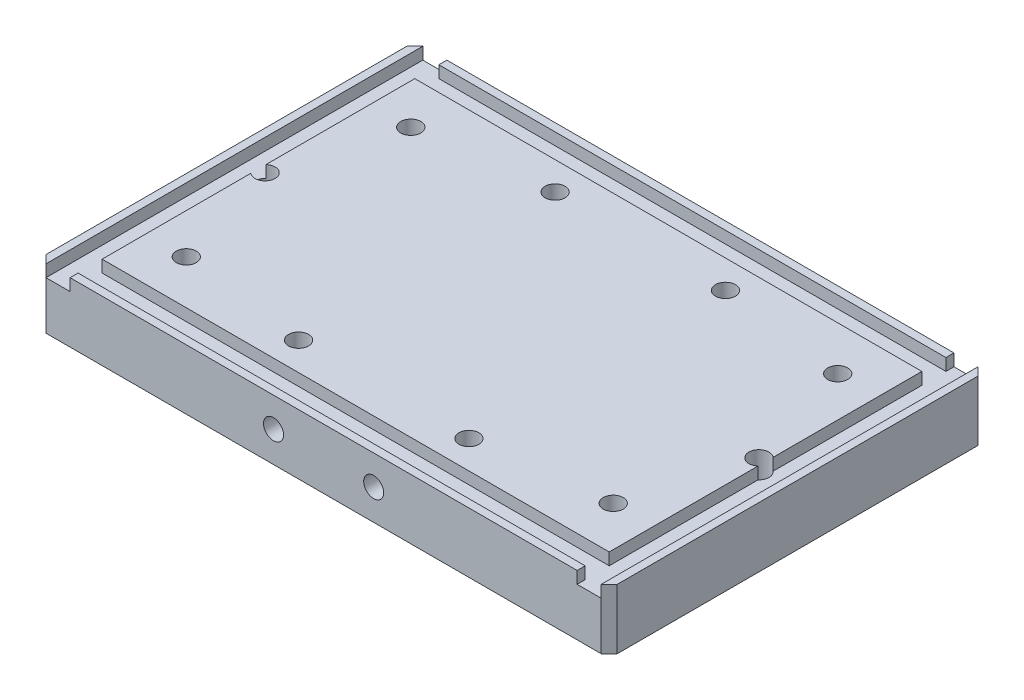
ISO-10303-21;
HEADER;
FILE_DESCRIPTION(('STEP AP214'),'2;1');
FILE_NAME('part.step','',(''),(''),'','','');
FILE_SCHEMA(('AUTOMOTIVE_DESIGN { 1 0 10303 214 1 1 1 1 }'));
ENDSEC;
DATA;
#1=APPLICATION_CONTEXT('core data for automotive mechanical design processes');
#2=APPLICATION_PROTOCOL_DEFINITION('international standard','automotive_design',2000,#1);
#3=PRODUCT_CONTEXT('',#1,'mechanical');
#4=PRODUCT('Part','Part','',(#3));
#5=PRODUCT_RELATED_PRODUCT_CATEGORY('part','',(#4));
#6=PRODUCT_DEFINITION_FORMATION('','',#4);
#7=PRODUCT_DEFINITION_CONTEXT('part definition',#1,'design');
#8=PRODUCT_DEFINITION('design','',#6,#7);
#9=PRODUCT_DEFINITION_SHAPE('','',#8);
#10=(LENGTH_UNIT() NAMED_UNIT(*) SI_UNIT(.MILLI.,.METRE.));
#11=(NAMED_UNIT(*) PLANE_ANGLE_UNIT() SI_UNIT($,.RADIAN.));
#12=(NAMED_UNIT(*) SI_UNIT($,.STERADIAN.) SOLID_ANGLE_UNIT());
#13=UNCERTAINTY_MEASURE_WITH_UNIT(LENGTH_MEASURE(1.E-05),#10,'distance_accuracy_value','');
#14=(GEOMETRIC_REPRESENTATION_CONTEXT(3) GLOBAL_UNCERTAINTY_ASSIGNED_CONTEXT((#13)) GLOBAL_UNIT_ASSIGNED_CONTEXT((#10,
#11,#12)) REPRESENTATION_CONTEXT('',''));
#15=CARTESIAN_POINT('',(0.,0.,0.));
#16=DIRECTION('',(0.,0.,1.));
#17=DIRECTION('',(1.,0.,0.));
#18=AXIS2_PLACEMENT_3D('',#15,#16,#17);
#19=CARTESIAN_POINT('',(134.5,12.,0.));
#20=DIRECTION('',(1.,0.,0.));
#21=DIRECTION('',(0.,0.,-1.));
#22=AXIS2_PLACEMENT_3D('',#19,#20,#21);
#23=PLANE('',#22);
#24=DIRECTION('',(0.,1.,0.));
#25=VECTOR('',#24,1.);
#26=CARTESIAN_POINT('',(134.5,0.,-48.8781639970993));
#27=LINE('',#26,#25);
#28=CARTESIAN_POINT('',(134.5,12.,-48.8781639970993));
#29=VERTEX_POINT('',#28);
#30=CARTESIAN_POINT('',(134.5,15.,-48.8781639970993));
#31=VERTEX_POINT('',#30);
#32=EDGE_CURVE('E221',#29,#31,#27,.T.);
#33=ORIENTED_EDGE('',*,*,#32,.F.);
#34=DIRECTION('',(0.,0.,-1.));
#35=VECTOR('',#34,1.);
#36=CARTESIAN_POINT('',(134.5,12.,0.));
#37=LINE('',#36,#35);
#38=CARTESIAN_POINT('',(134.5,12.,-86.));
#39=VERTEX_POINT('',#38);
#40=EDGE_CURVE('E285',#29,#39,#37,.T.);
#41=ORIENTED_EDGE('',*,*,#40,.T.);
#42=DIRECTION('',(0.,1.,0.));
#43=VECTOR('',#42,1.);
#44=CARTESIAN_POINT('',(134.5,12.,-86.));
#45=LINE('',#44,#43);
#46=CARTESIAN_POINT('',(134.5,15.,-86.));
#47=VERTEX_POINT('',#46);
#48=EDGE_CURVE('E325',#39,#47,#45,.T.);
#49=ORIENTED_EDGE('',*,*,#48,.T.);
#50=DIRECTION('',(0.,0.,-1.));
#51=VECTOR('',#50,1.);
#52=CARTESIAN_POINT('',(134.5,15.,0.));
#53=LINE('',#52,#51);
#54=EDGE_CURVE('E243',#31,#47,#53,.T.);
#55=ORIENTED_EDGE('',*,*,#54,.F.);
#56=EDGE_LOOP('',(#33,#41,#49,#55));
#57=FACE_BOUND('',#56,.T.);
#58=ADVANCED_FACE('F41',(#57),#23,.T.);
#59=CARTESIAN_POINT('',(8.,12.,0.));
#60=DIRECTION('',(1.,0.,0.));
#61=DIRECTION('',(0.,0.,-1.));
#62=AXIS2_PLACEMENT_3D('',#59,#60,#61);
#63=PLANE('',#62);
#64=DIRECTION('',(0.,0.,-1.));
#65=VECTOR('',#64,1.);
#66=CARTESIAN_POINT('',(8.,12.,0.));
#67=LINE('',#66,#65);
#68=CARTESIAN_POINT('',(8.,12.,-48.8781639970993));
#69=VERTEX_POINT('',#68);
#70=CARTESIAN_POINT('',(8.,12.,-86.));
#71=VERTEX_POINT('',#70);
#72=EDGE_CURVE('E269',#69,#71,#67,.T.);
#73=ORIENTED_EDGE('',*,*,#72,.F.);
#74=DIRECTION('',(0.,1.,0.));
#75=VECTOR('',#74,1.);
#76=CARTESIAN_POINT('',(8.,0.,-48.8781639970993));
#77=LINE('',#76,#75);
#78=CARTESIAN_POINT('',(8.,15.,-48.8781639970993));
#79=VERTEX_POINT('',#78);
#80=EDGE_CURVE('E277',#69,#79,#77,.T.);
#81=ORIENTED_EDGE('',*,*,#80,.T.);
#82=DIRECTION('',(0.,0.,-1.));
#83=VECTOR('',#82,1.);
#84=CARTESIAN_POINT('',(8.,15.,0.));
#85=LINE('',#84,#83);
#86=CARTESIAN_POINT('',(8.,15.,-86.));
#87=VERTEX_POINT('',#86);
#88=EDGE_CURVE('E314',#79,#87,#85,.T.);
#89=ORIENTED_EDGE('',*,*,#88,.T.);
#90=DIRECTION('',(0.,1.,0.));
#91=VECTOR('',#90,1.);
#92=CARTESIAN_POINT('',(8.,12.,-86.));
#93=LINE('',#92,#91);
#94=EDGE_CURVE('E327',#71,#87,#93,.T.);
#95=ORIENTED_EDGE('',*,*,#94,.F.);
#96=EDGE_LOOP('',(#73,#81,#89,#95));
#97=FACE_BOUND('',#96,.T.);
#98=ADVANCED_FACE('F451',(#97),#63,.F.);
#99=CARTESIAN_POINT('',(0.,15.,-94.));
#100=DIRECTION('',(0.,0.,1.));
#101=DIRECTION('',(1.,0.,0.));
#102=AXIS2_PLACEMENT_3D('',#99,#100,#101);
#103=PLANE('',#102);
#104=DIRECTION('',(-1.,0.,0.));
#105=VECTOR('',#104,1.);
#106=CARTESIAN_POINT('',(0.,0.,-94.));
#107=LINE('',#106,#105);
#108=CARTESIAN_POINT('',(140.5,0.,-94.));
#109=VERTEX_POINT('',#108);
#110=CARTESIAN_POINT('',(2.00000000000003,0.,-94.));
#111=VERTEX_POINT('',#110);
#112=EDGE_CURVE('E345',#109,#111,#107,.T.);
#113=ORIENTED_EDGE('',*,*,#112,.T.);
#114=DIRECTION('',(0.,1.,0.));
#115=VECTOR('',#114,1.);
#116=CARTESIAN_POINT('',(2.00000000000003,15.,-94.));
#117=LINE('',#116,#115);
#118=CARTESIAN_POINT('',(2.,12.,-94.));
#119=VERTEX_POINT('',#118);
#120=EDGE_CURVE('E385',#111,#119,#117,.T.);
#121=ORIENTED_EDGE('',*,*,#120,.T.);
#122=DIRECTION('',(-1.,0.,0.));
#123=VECTOR('',#122,1.);
#124=CARTESIAN_POINT('',(0.,12.,-94.));
#125=LINE('',#124,#123);
#126=CARTESIAN_POINT('',(8.,12.,-94.));
#127=VERTEX_POINT('',#126);
#128=EDGE_CURVE('E291',#127,#119,#125,.T.);
#129=ORIENTED_EDGE('',*,*,#128,.F.);
#130=DIRECTION('',(0.,1.,0.));
#131=VECTOR('',#130,1.);
#132=CARTESIAN_POINT('',(8.,12.,-94.));
#133=LINE('',#132,#131);
#134=CARTESIAN_POINT('',(8.,15.,-94.));
#135=VERTEX_POINT('',#134);
#136=EDGE_CURVE('E431',#127,#135,#133,.T.);
#137=ORIENTED_EDGE('',*,*,#136,.T.);
#138=DIRECTION('',(-1.,0.,0.));
#139=VECTOR('',#138,1.);
#140=CARTESIAN_POINT('',(0.,15.,-94.));
#141=LINE('',#140,#139);
#142=CARTESIAN_POINT('',(134.5,15.,-94.));
#143=VERTEX_POINT('',#142);
#144=EDGE_CURVE('E226',#143,#135,#141,.T.);
#145=ORIENTED_EDGE('',*,*,#144,.F.);
#146=DIRECTION('',(0.,1.,0.));
#147=VECTOR('',#146,1.);
#148=CARTESIAN_POINT('',(134.5,12.,-94.));
#149=LINE('',#148,#147);
#150=CARTESIAN_POINT('',(134.5,12.,-94.));
#151=VERTEX_POINT('',#150);
#152=EDGE_CURVE('E414',#151,#143,#149,.T.);
#153=ORIENTED_EDGE('',*,*,#152,.F.);
#154=DIRECTION('',(-1.,0.,0.));
#155=VECTOR('',#154,1.);
#156=CARTESIAN_POINT('',(0.,12.,-94.));
#157=LINE('',#156,#155);
#158=CARTESIAN_POINT('',(140.5,12.,-94.));
#159=VERTEX_POINT('',#158);
#160=EDGE_CURVE('E309',#159,#151,#157,.T.);
#161=ORIENTED_EDGE('',*,*,#160,.F.);
#162=DIRECTION('',(0.,-1.,0.));
#163=VECTOR('',#162,1.);
#164=CARTESIAN_POINT('',(140.5,15.,-94.));
#165=LINE('',#164,#163);
#166=EDGE_CURVE('E383',#159,#109,#165,.T.);
#167=ORIENTED_EDGE('',*,*,#166,.T.);
#168=EDGE_LOOP('',(#113,#121,#129,#137,#145,#153,#161,#167));
#169=FACE_BOUND('',#168,.T.);
#170=ADVANCED_FACE('F573',(#169),#103,.F.);
#171=CARTESIAN_POINT('',(0.,15.,0.));
#172=DIRECTION('',(0.,-1.,0.));
#173=DIRECTION('',(0.,0.,-1.));
#174=AXIS2_PLACEMENT_3D('',#171,#172,#173);
#175=PLANE('',#174);
#176=CARTESIAN_POINT('',(134.5,15.,0.));
#177=VERTEX_POINT('',#176);
#178=CARTESIAN_POINT('',(134.5,15.,-2.));
#179=VERTEX_POINT('',#178);
#180=EDGE_CURVE('E245',#177,#179,#53,.T.);
#181=ORIENTED_EDGE('',*,*,#180,.T.);
#182=DIRECTION('',(1.,0.,0.));
#183=VECTOR('',#182,1.);
#184=CARTESIAN_POINT('',(0.,15.,-2.));
#185=LINE('',#184,#183);
#186=CARTESIAN_POINT('',(8.,15.,-2.));
#187=VERTEX_POINT('',#186);
#188=EDGE_CURVE('E254',#187,#179,#185,.T.);
#189=ORIENTED_EDGE('',*,*,#188,.F.);
#190=CARTESIAN_POINT('',(8.,15.,0.));
#191=VERTEX_POINT('',#190);
#192=EDGE_CURVE('E261',#191,#187,#85,.T.);
#193=ORIENTED_EDGE('',*,*,#192,.F.);
#194=DIRECTION('',(1.,0.,0.));
#195=VECTOR('',#194,1.);
#196=CARTESIAN_POINT('',(0.,15.,0.));
#197=LINE('',#196,#195);
#198=EDGE_CURVE('E344',#191,#177,#197,.T.);
#199=ORIENTED_EDGE('',*,*,#198,.T.);
#200=EDGE_LOOP('',(#181,#189,#193,#199));
#201=FACE_BOUND('',#200,.T.);
#202=ADVANCED_FACE('F619',(#201),#175,.F.);
#203=DIRECTION('',(0.,0.,1.));
#204=VECTOR('',#203,1.);
#205=CARTESIAN_POINT('',(0.,15.,0.));
#206=LINE('',#205,#204);
#207=CARTESIAN_POINT('',(0.,15.,-92.));
#208=VERTEX_POINT('',#207);
#209=CARTESIAN_POINT('',(0.,15.,-2.00000000000004));
#210=VERTEX_POINT('',#209);
#211=EDGE_CURVE('E341',#208,#210,#206,.T.);
#212=ORIENTED_EDGE('',*,*,#211,.T.);
#213=DIRECTION('',(-0.707106781186545,0.,-0.70710678118655));
#214=VECTOR('',#213,1.);
#215=CARTESIAN_POINT('',(2.00000000000003,15.,0.));
#216=LINE('',#215,#214);
#217=CARTESIAN_POINT('',(2.,15.,0.));
#218=VERTEX_POINT('',#217);
#219=EDGE_CURVE('E381',#210,#218,#216,.F.);
#220=ORIENTED_EDGE('',*,*,#219,.T.);
#221=DIRECTION('',(0.,0.,-1.));
#222=VECTOR('',#221,1.);
#223=CARTESIAN_POINT('',(2.,15.,0.));
#224=LINE('',#223,#222);
#225=CARTESIAN_POINT('',(2.,15.,-94.));
#226=VERTEX_POINT('',#225);
#227=EDGE_CURVE('E442',#218,#226,#224,.T.);
#228=ORIENTED_EDGE('',*,*,#227,.T.);
#229=DIRECTION('',(0.707106781186552,0.,-0.707106781186543));
#230=VECTOR('',#229,1.);
#231=CARTESIAN_POINT('',(0.,15.,-92.));
#232=LINE('',#231,#230);
#233=EDGE_CURVE('E379',#226,#208,#232,.F.);
#234=ORIENTED_EDGE('',*,*,#233,.T.);
#235=EDGE_LOOP('',(#212,#220,#228,#234));
#236=FACE_BOUND('',#235,.T.);
#237=ADVANCED_FACE('F621',(#236),#175,.F.);
#238=CARTESIAN_POINT('',(134.5,15.,-92.));
#239=VERTEX_POINT('',#238);
#240=EDGE_CURVE('E250',#239,#143,#53,.T.);
#241=ORIENTED_EDGE('',*,*,#240,.T.);
#242=ORIENTED_EDGE('',*,*,#144,.T.);
#243=CARTESIAN_POINT('',(8.,15.,-92.));
#244=VERTEX_POINT('',#243);
#245=EDGE_CURVE('E247',#244,#135,#85,.T.);
#246=ORIENTED_EDGE('',*,*,#245,.F.);
#247=DIRECTION('',(1.,0.,0.));
#248=VECTOR('',#247,1.);
#249=CARTESIAN_POINT('',(0.,15.,-92.));
#250=LINE('',#249,#248);
#251=EDGE_CURVE('E242',#244,#239,#250,.T.);
#252=ORIENTED_EDGE('',*,*,#251,.T.);
#253=EDGE_LOOP('',(#241,#242,#246,#252));
#254=FACE_BOUND('',#253,.T.);
#255=ADVANCED_FACE('F441',(#254),#175,.F.);
#256=CARTESIAN_POINT('',(0.,15.,0.));
#257=DIRECTION('',(1.,0.,0.));
#258=DIRECTION('',(0.,0.,-1.));
#259=AXIS2_PLACEMENT_3D('',#256,#257,#258);
#260=PLANE('',#259);
#261=DIRECTION('',(0.,0.,1.));
#262=VECTOR('',#261,1.);
#263=CARTESIAN_POINT('',(0.,0.,0.));
#264=LINE('',#263,#262);
#265=CARTESIAN_POINT('',(0.,0.,-92.));
#266=VERTEX_POINT('',#265);
#267=CARTESIAN_POINT('',(0.,0.,-2.00000000000004));
#268=VERTEX_POINT('',#267);
#269=EDGE_CURVE('E350',#266,#268,#264,.T.);
#270=ORIENTED_EDGE('',*,*,#269,.T.);
#271=DIRECTION('',(0.,1.,0.));
#272=VECTOR('',#271,1.);
#273=CARTESIAN_POINT('',(0.,15.,-2.00000000000004));
#274=LINE('',#273,#272);
#275=EDGE_CURVE('E377',#268,#210,#274,.T.);
#276=ORIENTED_EDGE('',*,*,#275,.T.);
#277=ORIENTED_EDGE('',*,*,#211,.F.);
#278=DIRECTION('',(0.,-1.,0.));
#279=VECTOR('',#278,1.);
#280=CARTESIAN_POINT('',(0.,15.,-92.));
#281=LINE('',#280,#279);
#282=EDGE_CURVE('E374',#208,#266,#281,.T.);
#283=ORIENTED_EDGE('',*,*,#282,.T.);
#284=EDGE_LOOP('',(#270,#276,#277,#283));
#285=FACE_BOUND('',#284,.T.);
#286=ADVANCED_FACE('F542',(#285),#260,.F.);
#287=CARTESIAN_POINT('',(0.,15.,0.));
#288=DIRECTION('',(0.,0.,-1.));
#289=DIRECTION('',(-1.,0.,0.));
#290=AXIS2_PLACEMENT_3D('',#287,#288,#289);
#291=PLANE('',#290);
#292=CARTESIAN_POINT('',(58.75,7.64622183218513,0.));
#293=DIRECTION('',(0.,0.,1.));
#294=DIRECTION('',(1.,0.,0.));
#295=AXIS2_PLACEMENT_3D('',#292,#293,#294);
#296=CIRCLE('',#295,2.5);
#297=CARTESIAN_POINT('',(61.25,7.64622183218513,0.));
#298=VERTEX_POINT('',#297);
#299=EDGE_CURVE('E524',#298,#298,#296,.T.);
#300=ORIENTED_EDGE('',*,*,#299,.F.);
#301=EDGE_LOOP('',(#300));
#302=FACE_BOUND('',#301,.T.);
#303=CARTESIAN_POINT('',(83.75,7.64622183218513,0.));
#304=DIRECTION('',(0.,0.,1.));
#305=DIRECTION('',(1.,0.,0.));
#306=AXIS2_PLACEMENT_3D('',#303,#304,#305);
#307=CIRCLE('',#306,2.49999999999999);
#308=CARTESIAN_POINT('',(86.25,7.64622183218513,0.));
#309=VERTEX_POINT('',#308);
#310=EDGE_CURVE('E521',#309,#309,#307,.T.);
#311=ORIENTED_EDGE('',*,*,#310,.F.);
#312=EDGE_LOOP('',(#311));
#313=FACE_BOUND('',#312,.T.);
#314=DIRECTION('',(1.,0.,0.));
#315=VECTOR('',#314,1.);
#316=CARTESIAN_POINT('',(0.,12.,0.));
#317=LINE('',#316,#315);
#318=CARTESIAN_POINT('',(2.,12.,0.));
#319=VERTEX_POINT('',#318);
#320=CARTESIAN_POINT('',(8.,12.,0.));
#321=VERTEX_POINT('',#320);
#322=EDGE_CURVE('E297',#319,#321,#317,.T.);
#323=ORIENTED_EDGE('',*,*,#322,.F.);
#324=DIRECTION('',(0.,-1.,0.));
#325=VECTOR('',#324,1.);
#326=CARTESIAN_POINT('',(2.00000000000003,15.,0.));
#327=LINE('',#326,#325);
#328=CARTESIAN_POINT('',(2.00000000000003,0.,0.));
#329=VERTEX_POINT('',#328);
#330=EDGE_CURVE('E364',#319,#329,#327,.T.);
#331=ORIENTED_EDGE('',*,*,#330,.T.);
#332=DIRECTION('',(1.,0.,0.));
#333=VECTOR('',#332,1.);
#334=CARTESIAN_POINT('',(0.,0.,0.));
#335=LINE('',#334,#333);
#336=CARTESIAN_POINT('',(140.5,0.,0.));
#337=VERTEX_POINT('',#336);
#338=EDGE_CURVE('E353',#329,#337,#335,.T.);
#339=ORIENTED_EDGE('',*,*,#338,.T.);
#340=DIRECTION('',(0.,1.,0.));
#341=VECTOR('',#340,1.);
#342=CARTESIAN_POINT('',(140.5,15.,0.));
#343=LINE('',#342,#341);
#344=CARTESIAN_POINT('',(140.5,12.,0.));
#345=VERTEX_POINT('',#344);
#346=EDGE_CURVE('E362',#337,#345,#343,.T.);
#347=ORIENTED_EDGE('',*,*,#346,.T.);
#348=DIRECTION('',(1.,0.,0.));
#349=VECTOR('',#348,1.);
#350=CARTESIAN_POINT('',(0.,12.,0.));
#351=LINE('',#350,#349);
#352=CARTESIAN_POINT('',(134.5,12.,0.));
#353=VERTEX_POINT('',#352);
#354=EDGE_CURVE('E303',#353,#345,#351,.T.);
#355=ORIENTED_EDGE('',*,*,#354,.F.);
#356=DIRECTION('',(0.,1.,0.));
#357=VECTOR('',#356,1.);
#358=CARTESIAN_POINT('',(134.5,12.,0.));
#359=LINE('',#358,#357);
#360=EDGE_CURVE('E412',#353,#177,#359,.T.);
#361=ORIENTED_EDGE('',*,*,#360,.T.);
#362=ORIENTED_EDGE('',*,*,#198,.F.);
#363=DIRECTION('',(0.,1.,0.));
#364=VECTOR('',#363,1.);
#365=CARTESIAN_POINT('',(8.,12.,0.));
#366=LINE('',#365,#364);
#367=EDGE_CURVE('E424',#321,#191,#366,.T.);
#368=ORIENTED_EDGE('',*,*,#367,.F.);
#369=EDGE_LOOP('',(#323,#331,#339,#347,#355,#361,#362,#368));
#370=FACE_BOUND('',#369,.T.);
#371=ADVANCED_FACE('F539',(#302,#313,#370),#291,.F.);
#372=CARTESIAN_POINT('',(142.5,15.,0.));
#373=DIRECTION('',(-1.,0.,0.));
#374=DIRECTION('',(0.,0.,1.));
#375=AXIS2_PLACEMENT_3D('',#372,#373,#374);
#376=PLANE('',#375);
#377=DIRECTION('',(0.,0.,-1.));
#378=VECTOR('',#377,1.);
#379=CARTESIAN_POINT('',(142.5,0.,0.));
#380=LINE('',#379,#378);
#381=CARTESIAN_POINT('',(142.5,0.,-2.00000000000003));
#382=VERTEX_POINT('',#381);
#383=CARTESIAN_POINT('',(142.5,0.,-92.));
#384=VERTEX_POINT('',#383);
#385=EDGE_CURVE('E357',#382,#384,#380,.T.);
#386=ORIENTED_EDGE('',*,*,#385,.T.);
#387=DIRECTION('',(0.,1.,0.));
#388=VECTOR('',#387,1.);
#389=CARTESIAN_POINT('',(142.5,15.,-92.));
#390=LINE('',#389,#388);
#391=CARTESIAN_POINT('',(142.5,15.,-92.));
#392=VERTEX_POINT('',#391);
#393=EDGE_CURVE('E57',#384,#392,#390,.T.);
#394=ORIENTED_EDGE('',*,*,#393,.T.);
#395=DIRECTION('',(0.,0.,-1.));
#396=VECTOR('',#395,1.);
#397=CARTESIAN_POINT('',(142.5,15.,0.));
#398=LINE('',#397,#396);
#399=CARTESIAN_POINT('',(142.5,15.,-2.00000000000003));
#400=VERTEX_POINT('',#399);
#401=EDGE_CURVE('E347',#400,#392,#398,.T.);
#402=ORIENTED_EDGE('',*,*,#401,.F.);
#403=DIRECTION('',(0.,-1.,0.));
#404=VECTOR('',#403,1.);
#405=CARTESIAN_POINT('',(142.5,15.,-2.00000000000003));
#406=LINE('',#405,#404);
#407=EDGE_CURVE('E387',#400,#382,#406,.T.);
#408=ORIENTED_EDGE('',*,*,#407,.T.);
#409=EDGE_LOOP('',(#386,#394,#402,#408));
#410=FACE_BOUND('',#409,.T.);
#411=ADVANCED_FACE('F392',(#410),#376,.F.);
#412=ORIENTED_EDGE('',*,*,#401,.T.);
#413=DIRECTION('',(0.70710678118655,0.,0.707106781186545));
#414=VECTOR('',#413,1.);
#415=CARTESIAN_POINT('',(140.5,15.,-94.));
#416=LINE('',#415,#414);
#417=CARTESIAN_POINT('',(140.5,15.,-94.));
#418=VERTEX_POINT('',#417);
#419=EDGE_CURVE('E11',#392,#418,#416,.F.);
#420=ORIENTED_EDGE('',*,*,#419,.T.);
#421=DIRECTION('',(0.,0.,-1.));
#422=VECTOR('',#421,1.);
#423=CARTESIAN_POINT('',(140.5,15.,0.));
#424=LINE('',#423,#422);
#425=CARTESIAN_POINT('',(140.5,15.,0.));
#426=VERTEX_POINT('',#425);
#427=EDGE_CURVE('E253',#426,#418,#424,.T.);
#428=ORIENTED_EDGE('',*,*,#427,.F.);
#429=DIRECTION('',(-0.707106781186552,0.,0.707106781186543));
#430=VECTOR('',#429,1.);
#431=CARTESIAN_POINT('',(142.5,15.,-2.00000000000003));
#432=LINE('',#431,#430);
#433=EDGE_CURVE('E50',#426,#400,#432,.F.);
#434=ORIENTED_EDGE('',*,*,#433,.T.);
#435=EDGE_LOOP('',(#412,#420,#428,#434));
#436=FACE_BOUND('',#435,.T.);
#437=ADVANCED_FACE('F405',(#436),#175,.F.);
#438=CARTESIAN_POINT('',(0.,0.,0.));
#439=DIRECTION('',(0.,-1.,0.));
#440=DIRECTION('',(0.,0.,-1.));
#441=AXIS2_PLACEMENT_3D('',#438,#439,#440);
#442=PLANE('',#441);
#443=CARTESIAN_POINT('',(124.5,0.,-19.));
#444=DIRECTION('',(0.,1.,0.));
#445=DIRECTION('',(0.,0.,1.));
#446=AXIS2_PLACEMENT_3D('',#443,#444,#445);
#447=CIRCLE('',#446,2.49999999999998);
#448=CARTESIAN_POINT('',(124.5,0.,-16.5));
#449=VERTEX_POINT('',#448);
#450=EDGE_CURVE('E500',#449,#449,#447,.T.);
#451=ORIENTED_EDGE('',*,*,#450,.T.);
#452=EDGE_LOOP('',(#451));
#453=FACE_BOUND('',#452,.T.);
#454=CARTESIAN_POINT('',(18.,0.,-19.));
#455=DIRECTION('',(0.,1.,0.));
#456=DIRECTION('',(0.,0.,1.));
#457=AXIS2_PLACEMENT_3D('',#454,#455,#456);
#458=CIRCLE('',#457,2.5);
#459=CARTESIAN_POINT('',(18.,0.,-16.5));
#460=VERTEX_POINT('',#459);
#461=EDGE_CURVE('E507',#460,#460,#458,.T.);
#462=ORIENTED_EDGE('',*,*,#461,.T.);
#463=EDGE_LOOP('',(#462));
#464=FACE_BOUND('',#463,.T.);
#465=CARTESIAN_POINT('',(18.,0.,-75.));
#466=DIRECTION('',(0.,1.,0.));
#467=DIRECTION('',(0.,0.,1.));
#468=AXIS2_PLACEMENT_3D('',#465,#466,#467);
#469=CIRCLE('',#468,2.5);
#470=CARTESIAN_POINT('',(18.,0.,-72.5));
#471=VERTEX_POINT('',#470);
#472=EDGE_CURVE('E513',#471,#471,#469,.T.);
#473=ORIENTED_EDGE('',*,*,#472,.T.);
#474=EDGE_LOOP('',(#473));
#475=FACE_BOUND('',#474,.T.);
#476=CARTESIAN_POINT('',(124.5,0.,-75.));
#477=DIRECTION('',(0.,1.,0.));
#478=DIRECTION('',(0.,0.,1.));
#479=AXIS2_PLACEMENT_3D('',#476,#477,#478);
#480=CIRCLE('',#479,2.49999999999998);
#481=CARTESIAN_POINT('',(124.5,0.,-72.5));
#482=VERTEX_POINT('',#481);
#483=EDGE_CURVE('E491',#482,#482,#480,.T.);
#484=ORIENTED_EDGE('',*,*,#483,.T.);
#485=EDGE_LOOP('',(#484));
#486=FACE_BOUND('',#485,.T.);
#487=CARTESIAN_POINT('',(92.5,0.,-79.));
#488=DIRECTION('',(0.,1.,0.));
#489=DIRECTION('',(0.,0.,1.));
#490=AXIS2_PLACEMENT_3D('',#487,#488,#489);
#491=CIRCLE('',#490,2.50000000000001);
#492=CARTESIAN_POINT('',(92.5,0.,-76.5));
#493=VERTEX_POINT('',#492);
#494=EDGE_CURVE('E483',#493,#493,#491,.T.);
#495=ORIENTED_EDGE('',*,*,#494,.T.);
#496=EDGE_LOOP('',(#495));
#497=FACE_BOUND('',#496,.T.);
#498=CARTESIAN_POINT('',(50.,0.,-15.));
#499=DIRECTION('',(0.,1.,0.));
#500=DIRECTION('',(0.,0.,1.));
#501=AXIS2_PLACEMENT_3D('',#498,#499,#500);
#502=CIRCLE('',#501,2.5);
#503=CARTESIAN_POINT('',(50.,0.,-12.5));
#504=VERTEX_POINT('',#503);
#505=EDGE_CURVE('E476',#504,#504,#502,.T.);
#506=ORIENTED_EDGE('',*,*,#505,.T.);
#507=EDGE_LOOP('',(#506));
#508=FACE_BOUND('',#507,.T.);
#509=CARTESIAN_POINT('',(92.5,0.,-15.));
#510=DIRECTION('',(0.,1.,0.));
#511=DIRECTION('',(0.,0.,1.));
#512=AXIS2_PLACEMENT_3D('',#509,#510,#511);
#513=CIRCLE('',#512,2.50000000000001);
#514=CARTESIAN_POINT('',(92.5,0.,-12.5));
#515=VERTEX_POINT('',#514);
#516=EDGE_CURVE('E488',#515,#515,#513,.T.);
#517=ORIENTED_EDGE('',*,*,#516,.T.);
#518=EDGE_LOOP('',(#517));
#519=FACE_BOUND('',#518,.T.);
#520=CARTESIAN_POINT('',(50.,0.,-79.));
#521=DIRECTION('',(0.,1.,0.));
#522=DIRECTION('',(0.,0.,1.));
#523=AXIS2_PLACEMENT_3D('',#520,#521,#522);
#524=CIRCLE('',#523,2.5);
#525=CARTESIAN_POINT('',(50.,0.,-76.5));
#526=VERTEX_POINT('',#525);
#527=EDGE_CURVE('E467',#526,#526,#524,.T.);
#528=ORIENTED_EDGE('',*,*,#527,.T.);
#529=EDGE_LOOP('',(#528));
#530=FACE_BOUND('',#529,.T.);
#531=CARTESIAN_POINT('',(9.65000000000001,0.,-47.));
#532=DIRECTION('',(0.,1.,0.));
#533=DIRECTION('',(0.,0.,1.));
#534=AXIS2_PLACEMENT_3D('',#531,#532,#533);
#535=CIRCLE('',#534,2.50000000000001);
#536=CARTESIAN_POINT('',(9.65000000000001,0.,-44.5));
#537=VERTEX_POINT('',#536);
#538=EDGE_CURVE('E463',#537,#537,#535,.T.);
#539=ORIENTED_EDGE('',*,*,#538,.T.);
#540=EDGE_LOOP('',(#539));
#541=FACE_BOUND('',#540,.T.);
#542=CARTESIAN_POINT('',(132.85,0.,-47.));
#543=DIRECTION('',(0.,1.,0.));
#544=DIRECTION('',(0.,0.,1.));
#545=AXIS2_PLACEMENT_3D('',#542,#543,#544);
#546=CIRCLE('',#545,2.5);
#547=CARTESIAN_POINT('',(132.85,0.,-44.5));
#548=VERTEX_POINT('',#547);
#549=EDGE_CURVE('E464',#548,#548,#546,.T.);
#550=ORIENTED_EDGE('',*,*,#549,.T.);
#551=EDGE_LOOP('',(#550));
#552=FACE_BOUND('',#551,.T.);
#553=ORIENTED_EDGE('',*,*,#338,.F.);
#554=DIRECTION('',(0.707106781186545,0.,0.70710678118655));
#555=VECTOR('',#554,1.);
#556=CARTESIAN_POINT('',(1.00000000000002,0.,-1.00000000000001));
#557=LINE('',#556,#555);
#558=EDGE_CURVE('E372',#329,#268,#557,.F.);
#559=ORIENTED_EDGE('',*,*,#558,.T.);
#560=ORIENTED_EDGE('',*,*,#269,.F.);
#561=DIRECTION('',(-0.707106781186552,0.,0.707106781186543));
#562=VECTOR('',#561,1.);
#563=CARTESIAN_POINT('',(-46.,0.,-46.0000000000006));
#564=LINE('',#563,#562);
#565=EDGE_CURVE('E370',#266,#111,#564,.F.);
#566=ORIENTED_EDGE('',*,*,#565,.T.);
#567=ORIENTED_EDGE('',*,*,#112,.F.);
#568=DIRECTION('',(-0.70710678118655,0.,-0.707106781186545));
#569=VECTOR('',#568,1.);
#570=CARTESIAN_POINT('',(117.249999999999,0.,-117.25));
#571=LINE('',#570,#569);
#572=EDGE_CURVE('E368',#109,#384,#571,.F.);
#573=ORIENTED_EDGE('',*,*,#572,.T.);
#574=ORIENTED_EDGE('',*,*,#385,.F.);
#575=DIRECTION('',(0.707106781186552,0.,-0.707106781186543));
#576=VECTOR('',#575,1.);
#577=CARTESIAN_POINT('',(70.249999999999,0.,70.25));
#578=LINE('',#577,#576);
#579=EDGE_CURVE('E366',#382,#337,#578,.F.);
#580=ORIENTED_EDGE('',*,*,#579,.T.);
#581=EDGE_LOOP('',(#553,#559,#560,#566,#567,#573,#574,#580));
#582=FACE_BOUND('',#581,.T.);
#583=ADVANCED_FACE('F396',(#453,#464,#475,#486,#497,#508,#519,#530,#541,#552,#582),#442,.T.);
#584=CARTESIAN_POINT('',(0.,12.,-92.));
#585=DIRECTION('',(0.,0.,1.));
#586=DIRECTION('',(1.,0.,0.));
#587=AXIS2_PLACEMENT_3D('',#584,#585,#586);
#588=PLANE('',#587);
#589=ORIENTED_EDGE('',*,*,#251,.F.);
#590=DIRECTION('',(0.,1.,0.));
#591=VECTOR('',#590,1.);
#592=CARTESIAN_POINT('',(8.,12.,-92.));
#593=LINE('',#592,#591);
#594=CARTESIAN_POINT('',(8.,12.,-92.));
#595=VERTEX_POINT('',#594);
#596=EDGE_CURVE('E333',#595,#244,#593,.T.);
#597=ORIENTED_EDGE('',*,*,#596,.F.);
#598=DIRECTION('',(1.,0.,0.));
#599=VECTOR('',#598,1.);
#600=CARTESIAN_POINT('',(0.,12.,-92.));
#601=LINE('',#600,#599);
#602=CARTESIAN_POINT('',(134.5,12.,-92.));
#603=VERTEX_POINT('',#602);
#604=EDGE_CURVE('E287',#595,#603,#601,.T.);
#605=ORIENTED_EDGE('',*,*,#604,.T.);
#606=DIRECTION('',(0.,1.,0.));
#607=VECTOR('',#606,1.);
#608=CARTESIAN_POINT('',(134.5,12.,-92.));
#609=LINE('',#608,#607);
#610=EDGE_CURVE('E354',#603,#239,#609,.T.);
#611=ORIENTED_EDGE('',*,*,#610,.T.);
#612=EDGE_LOOP('',(#589,#597,#605,#611));
#613=FACE_BOUND('',#612,.T.);
#614=ADVANCED_FACE('F602',(#613),#588,.T.);
#615=ORIENTED_EDGE('',*,*,#240,.F.);
#616=ORIENTED_EDGE('',*,*,#610,.F.);
#617=EDGE_CURVE('E312',#603,#151,#37,.T.);
#618=ORIENTED_EDGE('',*,*,#617,.T.);
#619=ORIENTED_EDGE('',*,*,#152,.T.);
#620=EDGE_LOOP('',(#615,#616,#618,#619));
#621=FACE_BOUND('',#620,.T.);
#622=ADVANCED_FACE('F589',(#621),#23,.T.);
#623=CARTESIAN_POINT('',(140.5,12.,0.));
#624=DIRECTION('',(1.,0.,0.));
#625=DIRECTION('',(0.,0.,-1.));
#626=AXIS2_PLACEMENT_3D('',#623,#624,#625);
#627=PLANE('',#626);
#628=ORIENTED_EDGE('',*,*,#427,.T.);
#629=DIRECTION('',(0.,1.,0.));
#630=VECTOR('',#629,1.);
#631=CARTESIAN_POINT('',(140.5,12.,-94.));
#632=LINE('',#631,#630);
#633=EDGE_CURVE('E404',#159,#418,#632,.T.);
#634=ORIENTED_EDGE('',*,*,#633,.F.);
#635=DIRECTION('',(0.,0.,-1.));
#636=VECTOR('',#635,1.);
#637=CARTESIAN_POINT('',(140.5,12.,0.));
#638=LINE('',#637,#636);
#639=EDGE_CURVE('E306',#345,#159,#638,.T.);
#640=ORIENTED_EDGE('',*,*,#639,.F.);
#641=DIRECTION('',(0.,1.,0.));
#642=VECTOR('',#641,1.);
#643=CARTESIAN_POINT('',(140.5,12.,0.));
#644=LINE('',#643,#642);
#645=EDGE_CURVE('E410',#345,#426,#644,.T.);
#646=ORIENTED_EDGE('',*,*,#645,.T.);
#647=EDGE_LOOP('',(#628,#634,#640,#646));
#648=FACE_BOUND('',#647,.T.);
#649=ADVANCED_FACE('F407',(#648),#627,.F.);
#650=ORIENTED_EDGE('',*,*,#180,.F.);
#651=ORIENTED_EDGE('',*,*,#360,.F.);
#652=CARTESIAN_POINT('',(134.5,12.,-2.));
#653=VERTEX_POINT('',#652);
#654=EDGE_CURVE('E288',#353,#653,#37,.T.);
#655=ORIENTED_EDGE('',*,*,#654,.T.);
#656=DIRECTION('',(0.,1.,0.));
#657=VECTOR('',#656,1.);
#658=CARTESIAN_POINT('',(134.5,12.,-2.));
#659=LINE('',#658,#657);
#660=EDGE_CURVE('E417',#653,#179,#659,.T.);
#661=ORIENTED_EDGE('',*,*,#660,.T.);
#662=EDGE_LOOP('',(#650,#651,#655,#661));
#663=FACE_BOUND('',#662,.T.);
#664=ADVANCED_FACE('F600',(#663),#23,.T.);
#665=CARTESIAN_POINT('',(0.,12.,-2.));
#666=DIRECTION('',(0.,0.,1.));
#667=DIRECTION('',(1.,0.,0.));
#668=AXIS2_PLACEMENT_3D('',#665,#666,#667);
#669=PLANE('',#668);
#670=ORIENTED_EDGE('',*,*,#188,.T.);
#671=ORIENTED_EDGE('',*,*,#660,.F.);
#672=DIRECTION('',(1.,0.,0.));
#673=VECTOR('',#672,1.);
#674=CARTESIAN_POINT('',(0.,12.,-2.));
#675=LINE('',#674,#673);
#676=CARTESIAN_POINT('',(8.,12.,-2.));
#677=VERTEX_POINT('',#676);
#678=EDGE_CURVE('E300',#677,#653,#675,.T.);
#679=ORIENTED_EDGE('',*,*,#678,.F.);
#680=DIRECTION('',(0.,1.,0.));
#681=VECTOR('',#680,1.);
#682=CARTESIAN_POINT('',(8.,12.,-2.));
#683=LINE('',#682,#681);
#684=EDGE_CURVE('E422',#677,#187,#683,.T.);
#685=ORIENTED_EDGE('',*,*,#684,.T.);
#686=EDGE_LOOP('',(#670,#671,#679,#685));
#687=FACE_BOUND('',#686,.T.);
#688=ADVANCED_FACE('F610',(#687),#669,.F.);
#689=ORIENTED_EDGE('',*,*,#192,.T.);
#690=ORIENTED_EDGE('',*,*,#684,.F.);
#691=EDGE_CURVE('E275',#321,#677,#67,.T.);
#692=ORIENTED_EDGE('',*,*,#691,.F.);
#693=ORIENTED_EDGE('',*,*,#367,.T.);
#694=EDGE_LOOP('',(#689,#690,#692,#693));
#695=FACE_BOUND('',#694,.T.);
#696=ADVANCED_FACE('F595',(#695),#63,.F.);
#697=CARTESIAN_POINT('',(2.,12.,0.));
#698=DIRECTION('',(1.,0.,0.));
#699=DIRECTION('',(0.,0.,-1.));
#700=AXIS2_PLACEMENT_3D('',#697,#698,#699);
#701=PLANE('',#700);
#702=ORIENTED_EDGE('',*,*,#227,.F.);
#703=DIRECTION('',(0.,1.,0.));
#704=VECTOR('',#703,1.);
#705=CARTESIAN_POINT('',(2.,12.,0.));
#706=LINE('',#705,#704);
#707=EDGE_CURVE('E426',#319,#218,#706,.T.);
#708=ORIENTED_EDGE('',*,*,#707,.F.);
#709=DIRECTION('',(0.,0.,-1.));
#710=VECTOR('',#709,1.);
#711=CARTESIAN_POINT('',(2.,12.,0.));
#712=LINE('',#711,#710);
#713=EDGE_CURVE('E294',#319,#119,#712,.T.);
#714=ORIENTED_EDGE('',*,*,#713,.T.);
#715=DIRECTION('',(0.,1.,0.));
#716=VECTOR('',#715,1.);
#717=CARTESIAN_POINT('',(2.,12.,-94.));
#718=LINE('',#717,#716);
#719=EDGE_CURVE('E429',#119,#226,#718,.T.);
#720=ORIENTED_EDGE('',*,*,#719,.T.);
#721=EDGE_LOOP('',(#702,#708,#714,#720));
#722=FACE_BOUND('',#721,.T.);
#723=ADVANCED_FACE('F558',(#722),#701,.T.);
#724=CARTESIAN_POINT('',(0.,12.,-8.));
#725=DIRECTION('',(0.,0.,1.));
#726=DIRECTION('',(1.,0.,0.));
#727=AXIS2_PLACEMENT_3D('',#724,#725,#726);
#728=PLANE('',#727);
#729=DIRECTION('',(1.,0.,0.));
#730=VECTOR('',#729,1.);
#731=CARTESIAN_POINT('',(0.,15.,-8.));
#732=LINE('',#731,#730);
#733=CARTESIAN_POINT('',(8.,15.,-8.));
#734=VERTEX_POINT('',#733);
#735=CARTESIAN_POINT('',(134.5,15.,-8.));
#736=VERTEX_POINT('',#735);
#737=EDGE_CURVE('E241',#734,#736,#732,.T.);
#738=ORIENTED_EDGE('',*,*,#737,.F.);
#739=DIRECTION('',(0.,1.,0.));
#740=VECTOR('',#739,1.);
#741=CARTESIAN_POINT('',(8.00000000000001,12.,-8.));
#742=LINE('',#741,#740);
#743=CARTESIAN_POINT('',(8.00000000000001,12.,-8.));
#744=VERTEX_POINT('',#743);
#745=EDGE_CURVE('E335',#744,#734,#742,.T.);
#746=ORIENTED_EDGE('',*,*,#745,.F.);
#747=DIRECTION('',(1.,0.,0.));
#748=VECTOR('',#747,1.);
#749=CARTESIAN_POINT('',(0.,12.,-8.));
#750=LINE('',#749,#748);
#751=CARTESIAN_POINT('',(134.5,12.,-8.));
#752=VERTEX_POINT('',#751);
#753=EDGE_CURVE('E264',#744,#752,#750,.T.);
#754=ORIENTED_EDGE('',*,*,#753,.T.);
#755=DIRECTION('',(0.,1.,0.));
#756=VECTOR('',#755,1.);
#757=CARTESIAN_POINT('',(134.5,12.,-8.));
#758=LINE('',#757,#756);
#759=EDGE_CURVE('E331',#752,#736,#758,.T.);
#760=ORIENTED_EDGE('',*,*,#759,.T.);
#761=EDGE_LOOP('',(#738,#746,#754,#760));
#762=FACE_BOUND('',#761,.T.);
#763=ADVANCED_FACE('F599',(#762),#728,.T.);
#764=DIRECTION('',(0.,1.,0.));
#765=VECTOR('',#764,1.);
#766=CARTESIAN_POINT('',(134.5,0.,-45.1218360029007));
#767=LINE('',#766,#765);
#768=CARTESIAN_POINT('',(134.5,15.,-45.1218360029007));
#769=VERTEX_POINT('',#768);
#770=CARTESIAN_POINT('',(134.5,12.,-45.1218360029007));
#771=VERTEX_POINT('',#770);
#772=EDGE_CURVE('E218',#769,#771,#767,.F.);
#773=ORIENTED_EDGE('',*,*,#772,.F.);
#774=EDGE_CURVE('E232',#736,#769,#53,.T.);
#775=ORIENTED_EDGE('',*,*,#774,.F.);
#776=ORIENTED_EDGE('',*,*,#759,.F.);
#777=EDGE_CURVE('E234',#752,#771,#37,.T.);
#778=ORIENTED_EDGE('',*,*,#777,.T.);
#779=EDGE_LOOP('',(#773,#775,#776,#778));
#780=FACE_BOUND('',#779,.T.);
#781=ADVANCED_FACE('F230',(#780),#23,.T.);
#782=CARTESIAN_POINT('',(0.,12.,-86.));
#783=DIRECTION('',(0.,0.,1.));
#784=DIRECTION('',(1.,0.,0.));
#785=AXIS2_PLACEMENT_3D('',#782,#783,#784);
#786=PLANE('',#785);
#787=DIRECTION('',(1.,0.,0.));
#788=VECTOR('',#787,1.);
#789=CARTESIAN_POINT('',(0.,15.,-86.));
#790=LINE('',#789,#788);
#791=EDGE_CURVE('E249',#87,#47,#790,.T.);
#792=ORIENTED_EDGE('',*,*,#791,.T.);
#793=ORIENTED_EDGE('',*,*,#48,.F.);
#794=DIRECTION('',(1.,0.,0.));
#795=VECTOR('',#794,1.);
#796=CARTESIAN_POINT('',(0.,12.,-86.));
#797=LINE('',#796,#795);
#798=EDGE_CURVE('E281',#71,#39,#797,.T.);
#799=ORIENTED_EDGE('',*,*,#798,.F.);
#800=ORIENTED_EDGE('',*,*,#94,.T.);
#801=EDGE_LOOP('',(#792,#793,#799,#800));
#802=FACE_BOUND('',#801,.T.);
#803=ADVANCED_FACE('F322',(#802),#786,.F.);
#804=CARTESIAN_POINT('',(8.,15.,-45.1218360029007));
#805=VERTEX_POINT('',#804);
#806=EDGE_CURVE('E315',#734,#805,#85,.T.);
#807=ORIENTED_EDGE('',*,*,#806,.T.);
#808=DIRECTION('',(0.,1.,0.));
#809=VECTOR('',#808,1.);
#810=CARTESIAN_POINT('',(8.,0.,-45.1218360029007));
#811=LINE('',#810,#809);
#812=CARTESIAN_POINT('',(8.,12.,-45.1218360029007));
#813=VERTEX_POINT('',#812);
#814=EDGE_CURVE('E454',#805,#813,#811,.F.);
#815=ORIENTED_EDGE('',*,*,#814,.T.);
#816=EDGE_CURVE('E273',#744,#813,#67,.T.);
#817=ORIENTED_EDGE('',*,*,#816,.F.);
#818=ORIENTED_EDGE('',*,*,#745,.T.);
#819=EDGE_LOOP('',(#807,#815,#817,#818));
#820=FACE_BOUND('',#819,.T.);
#821=ADVANCED_FACE('F594',(#820),#63,.F.);
#822=ORIENTED_EDGE('',*,*,#245,.T.);
#823=ORIENTED_EDGE('',*,*,#136,.F.);
#824=EDGE_CURVE('E282',#595,#127,#67,.T.);
#825=ORIENTED_EDGE('',*,*,#824,.F.);
#826=ORIENTED_EDGE('',*,*,#596,.T.);
#827=EDGE_LOOP('',(#822,#823,#825,#826));
#828=FACE_BOUND('',#827,.T.);
#829=ADVANCED_FACE('F437',(#828),#63,.F.);
#830=CARTESIAN_POINT('',(0.,12.,0.));
#831=DIRECTION('',(0.,1.,0.));
#832=DIRECTION('',(0.,0.,1.));
#833=AXIS2_PLACEMENT_3D('',#830,#831,#832);
#834=PLANE('',#833);
#835=CARTESIAN_POINT('',(9.65000000000001,12.,-47.));
#836=DIRECTION('',(0.,1.,0.));
#837=DIRECTION('',(0.,0.,1.));
#838=AXIS2_PLACEMENT_3D('',#835,#836,#837);
#839=CIRCLE('',#838,2.50000000000001);
#840=EDGE_CURVE('E456',#69,#813,#839,.T.);
#841=ORIENTED_EDGE('',*,*,#840,.F.);
#842=ORIENTED_EDGE('',*,*,#72,.T.);
#843=ORIENTED_EDGE('',*,*,#798,.T.);
#844=ORIENTED_EDGE('',*,*,#40,.F.);
#845=CARTESIAN_POINT('',(132.85,12.,-47.));
#846=DIRECTION('',(0.,1.,0.));
#847=DIRECTION('',(0.,0.,1.));
#848=AXIS2_PLACEMENT_3D('',#845,#846,#847);
#849=CIRCLE('',#848,2.5);
#850=EDGE_CURVE('E235',#771,#29,#849,.T.);
#851=ORIENTED_EDGE('',*,*,#850,.F.);
#852=ORIENTED_EDGE('',*,*,#777,.F.);
#853=ORIENTED_EDGE('',*,*,#753,.F.);
#854=ORIENTED_EDGE('',*,*,#816,.T.);
#855=EDGE_LOOP('',(#841,#842,#843,#844,#851,#852,#853,#854));
#856=FACE_BOUND('',#855,.T.);
#857=ORIENTED_EDGE('',*,*,#604,.F.);
#858=ORIENTED_EDGE('',*,*,#824,.T.);
#859=ORIENTED_EDGE('',*,*,#128,.T.);
#860=ORIENTED_EDGE('',*,*,#713,.F.);
#861=ORIENTED_EDGE('',*,*,#322,.T.);
#862=ORIENTED_EDGE('',*,*,#691,.T.);
#863=ORIENTED_EDGE('',*,*,#678,.T.);
#864=ORIENTED_EDGE('',*,*,#654,.F.);
#865=ORIENTED_EDGE('',*,*,#354,.T.);
#866=ORIENTED_EDGE('',*,*,#639,.T.);
#867=ORIENTED_EDGE('',*,*,#160,.T.);
#868=ORIENTED_EDGE('',*,*,#617,.F.);
#869=EDGE_LOOP('',(#857,#858,#859,#860,#861,#862,#863,#864,#865,#866,#867,#868));
#870=FACE_BOUND('',#869,.T.);
#871=ADVANCED_FACE('F552',(#856,#870),#834,.T.);
#872=CARTESIAN_POINT('',(124.5,15.,-19.));
#873=DIRECTION('',(0.,1.,0.));
#874=DIRECTION('',(0.,0.,1.));
#875=AXIS2_PLACEMENT_3D('',#872,#873,#874);
#876=CIRCLE('',#875,2.49999999999998);
#877=CARTESIAN_POINT('',(124.5,15.,-16.5));
#878=VERTEX_POINT('',#877);
#879=EDGE_CURVE('E503',#878,#878,#876,.T.);
#880=ORIENTED_EDGE('',*,*,#879,.F.);
#881=EDGE_LOOP('',(#880));
#882=FACE_BOUND('',#881,.T.);
#883=CARTESIAN_POINT('',(18.,15.,-19.));
#884=DIRECTION('',(0.,1.,0.));
#885=DIRECTION('',(0.,0.,1.));
#886=AXIS2_PLACEMENT_3D('',#883,#884,#885);
#887=CIRCLE('',#886,2.5);
#888=CARTESIAN_POINT('',(18.,15.,-16.5));
#889=VERTEX_POINT('',#888);
#890=EDGE_CURVE('E510',#889,#889,#887,.T.);
#891=ORIENTED_EDGE('',*,*,#890,.F.);
#892=EDGE_LOOP('',(#891));
#893=FACE_BOUND('',#892,.T.);
#894=CARTESIAN_POINT('',(18.,15.,-75.));
#895=DIRECTION('',(0.,1.,0.));
#896=DIRECTION('',(0.,0.,1.));
#897=AXIS2_PLACEMENT_3D('',#894,#895,#896);
#898=CIRCLE('',#897,2.5);
#899=CARTESIAN_POINT('',(18.,15.,-72.5));
#900=VERTEX_POINT('',#899);
#901=EDGE_CURVE('E497',#900,#900,#898,.T.);
#902=ORIENTED_EDGE('',*,*,#901,.F.);
#903=EDGE_LOOP('',(#902));
#904=FACE_BOUND('',#903,.T.);
#905=CARTESIAN_POINT('',(124.5,15.,-75.));
#906=DIRECTION('',(0.,1.,0.));
#907=DIRECTION('',(0.,0.,1.));
#908=AXIS2_PLACEMENT_3D('',#905,#906,#907);
#909=CIRCLE('',#908,2.49999999999998);
#910=CARTESIAN_POINT('',(124.5,15.,-72.5));
#911=VERTEX_POINT('',#910);
#912=EDGE_CURVE('E494',#911,#911,#909,.T.);
#913=ORIENTED_EDGE('',*,*,#912,.F.);
#914=EDGE_LOOP('',(#913));
#915=FACE_BOUND('',#914,.T.);
#916=CARTESIAN_POINT('',(92.5,15.,-79.));
#917=DIRECTION('',(0.,1.,0.));
#918=DIRECTION('',(0.,0.,1.));
#919=AXIS2_PLACEMENT_3D('',#916,#917,#918);
#920=CIRCLE('',#919,2.50000000000001);
#921=CARTESIAN_POINT('',(92.5,15.,-76.5));
#922=VERTEX_POINT('',#921);
#923=EDGE_CURVE('E473',#922,#922,#920,.T.);
#924=ORIENTED_EDGE('',*,*,#923,.F.);
#925=EDGE_LOOP('',(#924));
#926=FACE_BOUND('',#925,.T.);
#927=CARTESIAN_POINT('',(50.,15.,-15.));
#928=DIRECTION('',(0.,1.,0.));
#929=DIRECTION('',(0.,0.,1.));
#930=AXIS2_PLACEMENT_3D('',#927,#928,#929);
#931=CIRCLE('',#930,2.5);
#932=CARTESIAN_POINT('',(50.,15.,-12.5));
#933=VERTEX_POINT('',#932);
#934=EDGE_CURVE('E479',#933,#933,#931,.T.);
#935=ORIENTED_EDGE('',*,*,#934,.F.);
#936=EDGE_LOOP('',(#935));
#937=FACE_BOUND('',#936,.T.);
#938=CARTESIAN_POINT('',(92.5,15.,-15.));
#939=DIRECTION('',(0.,1.,0.));
#940=DIRECTION('',(0.,0.,1.));
#941=AXIS2_PLACEMENT_3D('',#938,#939,#940);
#942=CIRCLE('',#941,2.50000000000001);
#943=CARTESIAN_POINT('',(92.5,15.,-12.5));
#944=VERTEX_POINT('',#943);
#945=EDGE_CURVE('E480',#944,#944,#942,.T.);
#946=ORIENTED_EDGE('',*,*,#945,.F.);
#947=EDGE_LOOP('',(#946));
#948=FACE_BOUND('',#947,.T.);
#949=CARTESIAN_POINT('',(50.,15.,-79.));
#950=DIRECTION('',(0.,1.,0.));
#951=DIRECTION('',(0.,0.,1.));
#952=AXIS2_PLACEMENT_3D('',#949,#950,#951);
#953=CIRCLE('',#952,2.5);
#954=CARTESIAN_POINT('',(50.,15.,-76.5));
#955=VERTEX_POINT('',#954);
#956=EDGE_CURVE('E470',#955,#955,#953,.T.);
#957=ORIENTED_EDGE('',*,*,#956,.F.);
#958=EDGE_LOOP('',(#957));
#959=FACE_BOUND('',#958,.T.);
#960=ORIENTED_EDGE('',*,*,#88,.F.);
#961=CARTESIAN_POINT('',(9.65000000000001,15.,-47.));
#962=DIRECTION('',(0.,-1.,0.));
#963=DIRECTION('',(0.,0.,-1.));
#964=AXIS2_PLACEMENT_3D('',#961,#962,#963);
#965=CIRCLE('',#964,2.50000000000001);
#966=EDGE_CURVE('E225',#79,#805,#965,.T.);
#967=ORIENTED_EDGE('',*,*,#966,.T.);
#968=ORIENTED_EDGE('',*,*,#806,.F.);
#969=ORIENTED_EDGE('',*,*,#737,.T.);
#970=ORIENTED_EDGE('',*,*,#774,.T.);
#971=CARTESIAN_POINT('',(132.85,15.,-47.));
#972=DIRECTION('',(0.,-1.,0.));
#973=DIRECTION('',(0.,0.,-1.));
#974=AXIS2_PLACEMENT_3D('',#971,#972,#973);
#975=CIRCLE('',#974,2.5);
#976=EDGE_CURVE('E214',#769,#31,#975,.T.);
#977=ORIENTED_EDGE('',*,*,#976,.T.);
#978=ORIENTED_EDGE('',*,*,#54,.T.);
#979=ORIENTED_EDGE('',*,*,#791,.F.);
#980=EDGE_LOOP('',(#960,#967,#968,#969,#970,#977,#978,#979));
#981=FACE_BOUND('',#980,.T.);
#982=ADVANCED_FACE('F239',(#882,#893,#904,#915,#926,#937,#948,#959,#981),#175,.F.);
#983=CARTESIAN_POINT('',(132.85,0.,-47.));
#984=DIRECTION('',(0.,1.,0.));
#985=DIRECTION('',(0.,0.,1.));
#986=AXIS2_PLACEMENT_3D('',#983,#984,#985);
#987=CYLINDRICAL_SURFACE('',#986,2.5);
#988=ORIENTED_EDGE('',*,*,#32,.T.);
#989=ORIENTED_EDGE('',*,*,#976,.F.);
#990=ORIENTED_EDGE('',*,*,#772,.T.);
#991=ORIENTED_EDGE('',*,*,#850,.T.);
#992=EDGE_LOOP('',(#988,#989,#990,#991));
#993=FACE_BOUND('',#992,.T.);
#994=ORIENTED_EDGE('',*,*,#549,.F.);
#995=EDGE_LOOP('',(#994));
#996=FACE_BOUND('',#995,.T.);
#997=ADVANCED_FACE('F216',(#993,#996),#987,.F.);
#998=CARTESIAN_POINT('',(9.65000000000001,0.,-47.));
#999=DIRECTION('',(0.,1.,0.));
#1000=DIRECTION('',(0.,0.,1.));
#1001=AXIS2_PLACEMENT_3D('',#998,#999,#1000);
#1002=CYLINDRICAL_SURFACE('',#1001,2.50000000000001);
#1003=ORIENTED_EDGE('',*,*,#538,.F.);
#1004=EDGE_LOOP('',(#1003));
#1005=FACE_BOUND('',#1004,.T.);
#1006=ORIENTED_EDGE('',*,*,#840,.T.);
#1007=ORIENTED_EDGE('',*,*,#814,.F.);
#1008=ORIENTED_EDGE('',*,*,#966,.F.);
#1009=ORIENTED_EDGE('',*,*,#80,.F.);
#1010=EDGE_LOOP('',(#1006,#1007,#1008,#1009));
#1011=FACE_BOUND('',#1010,.T.);
#1012=ADVANCED_FACE('F649',(#1005,#1011),#1002,.F.);
#1013=CARTESIAN_POINT('',(2.00000000000003,15.,0.));
#1014=DIRECTION('',(0.70710678118655,0.,-0.707106781186545));
#1015=DIRECTION('',(0.,-1.,0.));
#1016=AXIS2_PLACEMENT_3D('',#1013,#1014,#1015);
#1017=PLANE('',#1016);
#1018=ORIENTED_EDGE('',*,*,#219,.F.);
#1019=ORIENTED_EDGE('',*,*,#275,.F.);
#1020=ORIENTED_EDGE('',*,*,#558,.F.);
#1021=ORIENTED_EDGE('',*,*,#330,.F.);
#1022=ORIENTED_EDGE('',*,*,#707,.T.);
#1023=EDGE_LOOP('',(#1018,#1019,#1020,#1021,#1022));
#1024=FACE_BOUND('',#1023,.T.);
#1025=ADVANCED_FACE('F561',(#1024),#1017,.F.);
#1026=CARTESIAN_POINT('',(0.,15.,-92.));
#1027=DIRECTION('',(0.707106781186542,0.,0.707106781186552));
#1028=DIRECTION('',(0.,-1.,0.));
#1029=AXIS2_PLACEMENT_3D('',#1026,#1027,#1028);
#1030=PLANE('',#1029);
#1031=ORIENTED_EDGE('',*,*,#719,.F.);
#1032=ORIENTED_EDGE('',*,*,#120,.F.);
#1033=ORIENTED_EDGE('',*,*,#565,.F.);
#1034=ORIENTED_EDGE('',*,*,#282,.F.);
#1035=ORIENTED_EDGE('',*,*,#233,.F.);
#1036=EDGE_LOOP('',(#1031,#1032,#1033,#1034,#1035));
#1037=FACE_BOUND('',#1036,.T.);
#1038=ADVANCED_FACE('F570',(#1037),#1030,.F.);
#1039=CARTESIAN_POINT('',(140.5,15.,-94.));
#1040=DIRECTION('',(-0.707106781186545,0.,0.70710678118655));
#1041=DIRECTION('',(0.,-1.,0.));
#1042=AXIS2_PLACEMENT_3D('',#1039,#1040,#1041);
#1043=PLANE('',#1042);
#1044=ORIENTED_EDGE('',*,*,#419,.F.);
#1045=ORIENTED_EDGE('',*,*,#393,.F.);
#1046=ORIENTED_EDGE('',*,*,#572,.F.);
#1047=ORIENTED_EDGE('',*,*,#166,.F.);
#1048=ORIENTED_EDGE('',*,*,#633,.T.);
#1049=EDGE_LOOP('',(#1044,#1045,#1046,#1047,#1048));
#1050=FACE_BOUND('',#1049,.T.);
#1051=ADVANCED_FACE('F401',(#1050),#1043,.F.);
#1052=CARTESIAN_POINT('',(142.5,15.,-2.00000000000003));
#1053=DIRECTION('',(-0.707106781186543,0.,-0.707106781186552));
#1054=DIRECTION('',(0.,-1.,0.));
#1055=AXIS2_PLACEMENT_3D('',#1052,#1053,#1054);
#1056=PLANE('',#1055);
#1057=ORIENTED_EDGE('',*,*,#645,.F.);
#1058=ORIENTED_EDGE('',*,*,#346,.F.);
#1059=ORIENTED_EDGE('',*,*,#579,.F.);
#1060=ORIENTED_EDGE('',*,*,#407,.F.);
#1061=ORIENTED_EDGE('',*,*,#433,.F.);
#1062=EDGE_LOOP('',(#1057,#1058,#1059,#1060,#1061));
#1063=FACE_BOUND('',#1062,.T.);
#1064=ADVANCED_FACE('F44',(#1063),#1056,.F.);
#1065=CARTESIAN_POINT('',(50.,0.,-79.));
#1066=DIRECTION('',(0.,1.,0.));
#1067=DIRECTION('',(0.,0.,1.));
#1068=AXIS2_PLACEMENT_3D('',#1065,#1066,#1067);
#1069=CYLINDRICAL_SURFACE('',#1068,2.5);
#1070=ORIENTED_EDGE('',*,*,#527,.F.);
#1071=EDGE_LOOP('',(#1070));
#1072=FACE_BOUND('',#1071,.T.);
#1073=ORIENTED_EDGE('',*,*,#956,.T.);
#1074=EDGE_LOOP('',(#1073));
#1075=FACE_BOUND('',#1074,.T.);
#1076=ADVANCED_FACE('F579',(#1072,#1075),#1069,.F.);
#1077=CARTESIAN_POINT('',(92.5,0.,-15.));
#1078=DIRECTION('',(0.,1.,0.));
#1079=DIRECTION('',(0.,0.,1.));
#1080=AXIS2_PLACEMENT_3D('',#1077,#1078,#1079);
#1081=CYLINDRICAL_SURFACE('',#1080,2.50000000000001);
#1082=ORIENTED_EDGE('',*,*,#516,.F.);
#1083=EDGE_LOOP('',(#1082));
#1084=FACE_BOUND('',#1083,.T.);
#1085=ORIENTED_EDGE('',*,*,#945,.T.);
#1086=EDGE_LOOP('',(#1085));
#1087=FACE_BOUND('',#1086,.T.);
#1088=ADVANCED_FACE('F584',(#1084,#1087),#1081,.F.);
#1089=CARTESIAN_POINT('',(50.,0.,-15.));
#1090=DIRECTION('',(0.,1.,0.));
#1091=DIRECTION('',(0.,0.,1.));
#1092=AXIS2_PLACEMENT_3D('',#1089,#1090,#1091);
#1093=CYLINDRICAL_SURFACE('',#1092,2.5);
#1094=ORIENTED_EDGE('',*,*,#505,.F.);
#1095=EDGE_LOOP('',(#1094));
#1096=FACE_BOUND('',#1095,.T.);
#1097=ORIENTED_EDGE('',*,*,#934,.T.);
#1098=EDGE_LOOP('',(#1097));
#1099=FACE_BOUND('',#1098,.T.);
#1100=ADVANCED_FACE('F670',(#1096,#1099),#1093,.F.);
#1101=CARTESIAN_POINT('',(92.5,0.,-79.));
#1102=DIRECTION('',(0.,1.,0.));
#1103=DIRECTION('',(0.,0.,1.));
#1104=AXIS2_PLACEMENT_3D('',#1101,#1102,#1103);
#1105=CYLINDRICAL_SURFACE('',#1104,2.50000000000001);
#1106=ORIENTED_EDGE('',*,*,#494,.F.);
#1107=EDGE_LOOP('',(#1106));
#1108=FACE_BOUND('',#1107,.T.);
#1109=ORIENTED_EDGE('',*,*,#923,.T.);
#1110=EDGE_LOOP('',(#1109));
#1111=FACE_BOUND('',#1110,.T.);
#1112=ADVANCED_FACE('F676',(#1108,#1111),#1105,.F.);
#1113=CARTESIAN_POINT('',(124.5,0.,-75.));
#1114=DIRECTION('',(0.,1.,0.));
#1115=DIRECTION('',(0.,0.,1.));
#1116=AXIS2_PLACEMENT_3D('',#1113,#1114,#1115);
#1117=CYLINDRICAL_SURFACE('',#1116,2.49999999999998);
#1118=ORIENTED_EDGE('',*,*,#483,.F.);
#1119=EDGE_LOOP('',(#1118));
#1120=FACE_BOUND('',#1119,.T.);
#1121=ORIENTED_EDGE('',*,*,#912,.T.);
#1122=EDGE_LOOP('',(#1121));
#1123=FACE_BOUND('',#1122,.T.);
#1124=ADVANCED_FACE('F682',(#1120,#1123),#1117,.F.);
#1125=CARTESIAN_POINT('',(18.,0.,-75.));
#1126=DIRECTION('',(0.,1.,0.));
#1127=DIRECTION('',(0.,0.,1.));
#1128=AXIS2_PLACEMENT_3D('',#1125,#1126,#1127);
#1129=CYLINDRICAL_SURFACE('',#1128,2.5);
#1130=ORIENTED_EDGE('',*,*,#472,.F.);
#1131=EDGE_LOOP('',(#1130));
#1132=FACE_BOUND('',#1131,.T.);
#1133=ORIENTED_EDGE('',*,*,#901,.T.);
#1134=EDGE_LOOP('',(#1133));
#1135=FACE_BOUND('',#1134,.T.);
#1136=ADVANCED_FACE('F860',(#1132,#1135),#1129,.F.);
#1137=CARTESIAN_POINT('',(18.,0.,-19.));
#1138=DIRECTION('',(0.,1.,0.));
#1139=DIRECTION('',(0.,0.,1.));
#1140=AXIS2_PLACEMENT_3D('',#1137,#1138,#1139);
#1141=CYLINDRICAL_SURFACE('',#1140,2.5);
#1142=ORIENTED_EDGE('',*,*,#461,.F.);
#1143=EDGE_LOOP('',(#1142));
#1144=FACE_BOUND('',#1143,.T.);
#1145=ORIENTED_EDGE('',*,*,#890,.T.);
#1146=EDGE_LOOP('',(#1145));
#1147=FACE_BOUND('',#1146,.T.);
#1148=ADVANCED_FACE('F870',(#1144,#1147),#1141,.F.);
#1149=CARTESIAN_POINT('',(124.5,0.,-19.));
#1150=DIRECTION('',(0.,1.,0.));
#1151=DIRECTION('',(0.,0.,1.));
#1152=AXIS2_PLACEMENT_3D('',#1149,#1150,#1151);
#1153=CYLINDRICAL_SURFACE('',#1152,2.49999999999998);
#1154=ORIENTED_EDGE('',*,*,#450,.F.);
#1155=EDGE_LOOP('',(#1154));
#1156=FACE_BOUND('',#1155,.T.);
#1157=ORIENTED_EDGE('',*,*,#879,.T.);
#1158=EDGE_LOOP('',(#1157));
#1159=FACE_BOUND('',#1158,.T.);
#1160=ADVANCED_FACE('F881',(#1156,#1159),#1153,.F.);
#1161=CARTESIAN_POINT('',(83.75,7.64622183218513,-5.));
#1162=DIRECTION('',(0.,0.,1.));
#1163=DIRECTION('',(1.,0.,0.));
#1164=AXIS2_PLACEMENT_3D('',#1161,#1162,#1163);
#1165=CYLINDRICAL_SURFACE('',#1164,2.49999999999999);
#1166=CARTESIAN_POINT('',(83.75,7.64622183218513,-5.));
#1167=DIRECTION('',(0.,0.,1.));
#1168=DIRECTION('',(1.,0.,0.));
#1169=AXIS2_PLACEMENT_3D('',#1166,#1167,#1168);
#1170=CIRCLE('',#1169,2.49999999999999);
#1171=CARTESIAN_POINT('',(86.25,7.64622183218513,-5.));
#1172=VERTEX_POINT('',#1171);
#1173=EDGE_CURVE('E518',#1172,#1172,#1170,.T.);
#1174=ORIENTED_EDGE('',*,*,#1173,.F.);
#1175=EDGE_LOOP('',(#1174));
#1176=FACE_BOUND('',#1175,.T.);
#1177=ORIENTED_EDGE('',*,*,#310,.T.);
#1178=EDGE_LOOP('',(#1177));
#1179=FACE_BOUND('',#1178,.T.);
#1180=ADVANCED_FACE('F892',(#1176,#1179),#1165,.F.);
#1181=CARTESIAN_POINT('',(83.75,7.64622183218513,-5.));
#1182=DIRECTION('',(0.,0.,1.));
#1183=DIRECTION('',(1.,0.,0.));
#1184=AXIS2_PLACEMENT_3D('',#1181,#1182,#1183);
#1185=PLANE('',#1184);
#1186=ORIENTED_EDGE('',*,*,#1173,.T.);
#1187=EDGE_LOOP('',(#1186));
#1188=FACE_BOUND('',#1187,.T.);
#1189=ADVANCED_FACE('F535',(#1188),#1185,.T.);
#1190=CARTESIAN_POINT('',(58.75,7.64622183218513,-5.));
#1191=DIRECTION('',(0.,0.,1.));
#1192=DIRECTION('',(1.,0.,0.));
#1193=AXIS2_PLACEMENT_3D('',#1190,#1191,#1192);
#1194=CYLINDRICAL_SURFACE('',#1193,2.5);
#1195=CARTESIAN_POINT('',(58.75,7.64622183218513,-5.));
#1196=DIRECTION('',(0.,0.,1.));
#1197=DIRECTION('',(1.,0.,0.));
#1198=AXIS2_PLACEMENT_3D('',#1195,#1196,#1197);
#1199=CIRCLE('',#1198,2.5);
#1200=CARTESIAN_POINT('',(61.25,7.64622183218513,-5.));
#1201=VERTEX_POINT('',#1200);
#1202=EDGE_CURVE('E504',#1201,#1201,#1199,.T.);
#1203=ORIENTED_EDGE('',*,*,#1202,.F.);
#1204=EDGE_LOOP('',(#1203));
#1205=FACE_BOUND('',#1204,.T.);
#1206=ORIENTED_EDGE('',*,*,#299,.T.);
#1207=EDGE_LOOP('',(#1206));
#1208=FACE_BOUND('',#1207,.T.);
#1209=ADVANCED_FACE('F532',(#1205,#1208),#1194,.F.);
#1210=CARTESIAN_POINT('',(58.75,7.64622183218513,-5.));
#1211=DIRECTION('',(0.,0.,1.));
#1212=DIRECTION('',(1.,0.,0.));
#1213=AXIS2_PLACEMENT_3D('',#1210,#1211,#1212);
#1214=PLANE('',#1213);
#1215=ORIENTED_EDGE('',*,*,#1202,.T.);
#1216=EDGE_LOOP('',(#1215));
#1217=FACE_BOUND('',#1216,.T.);
#1218=ADVANCED_FACE('F530',(#1217),#1214,.T.);
#1219=CLOSED_SHELL('',(#58,#98,#170,#202,#237,#255,#286,#371,#411,#437,#583,#614,#622,#649,#664,
#688,#696,#723,#763,#781,#803,#821,#829,#871,#982,#997,#1012,#1025,#1038,#1051,#1064,#1076,
#1088,#1100,#1112,#1124,#1136,#1148,#1160,#1180,#1189,#1209,#1218));
#1220=MANIFOLD_SOLID_BREP('B2',#1219);
#1221=ADVANCED_BREP_SHAPE_REPRESENTATION('',(#18,#1220),#14);
#1222=SHAPE_DEFINITION_REPRESENTATION(#9,#1221);
ENDSEC;
END-ISO-10303-21;
